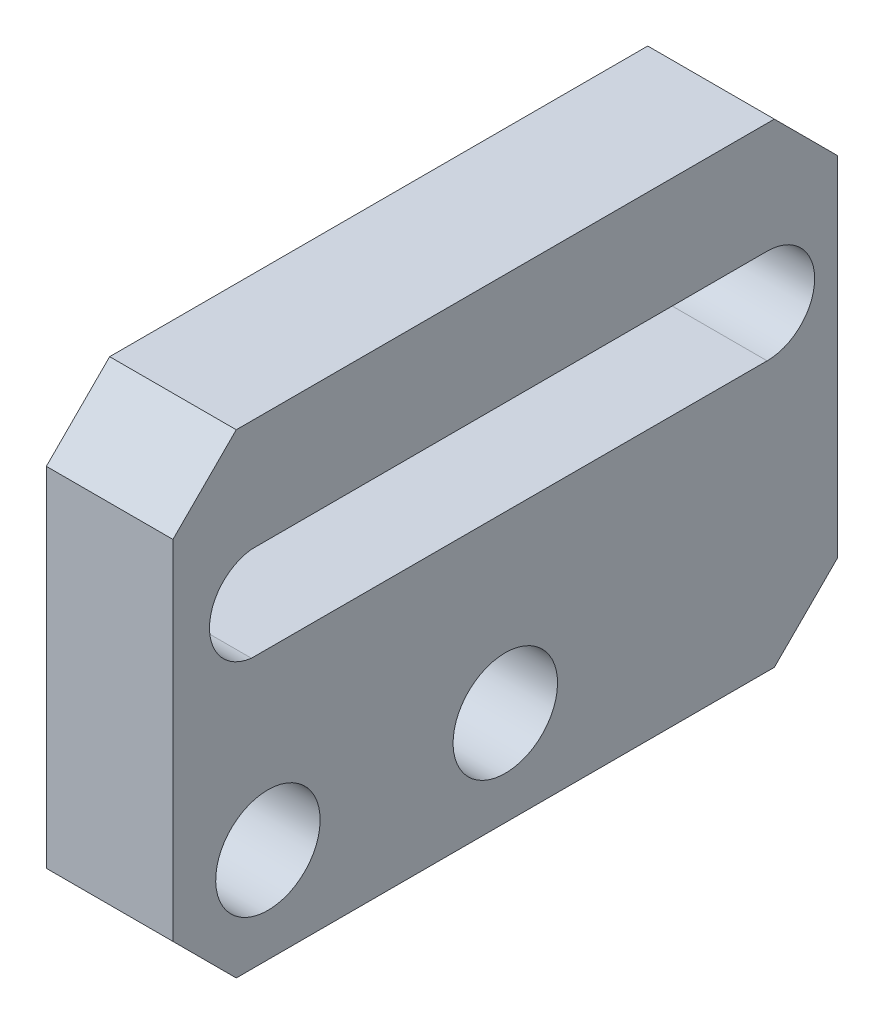
ISO-10303-21;
HEADER;
FILE_DESCRIPTION(('STEP AP214'),'2;1');
FILE_NAME('part.step','',(''),(''),'','','');
FILE_SCHEMA(('AUTOMOTIVE_DESIGN { 1 0 10303 214 1 1 1 1 }'));
ENDSEC;
DATA;
#1=APPLICATION_CONTEXT('core data for automotive mechanical design processes');
#2=APPLICATION_PROTOCOL_DEFINITION('international standard','automotive_design',2000,#1);
#3=PRODUCT_CONTEXT('',#1,'mechanical');
#4=PRODUCT('Part','Part','',(#3));
#5=PRODUCT_RELATED_PRODUCT_CATEGORY('part','',(#4));
#6=PRODUCT_DEFINITION_FORMATION('','',#4);
#7=PRODUCT_DEFINITION_CONTEXT('part definition',#1,'design');
#8=PRODUCT_DEFINITION('design','',#6,#7);
#9=PRODUCT_DEFINITION_SHAPE('','',#8);
#10=(LENGTH_UNIT() NAMED_UNIT(*) SI_UNIT(.MILLI.,.METRE.));
#11=(NAMED_UNIT(*) PLANE_ANGLE_UNIT() SI_UNIT($,.RADIAN.));
#12=(NAMED_UNIT(*) SI_UNIT($,.STERADIAN.) SOLID_ANGLE_UNIT());
#13=UNCERTAINTY_MEASURE_WITH_UNIT(LENGTH_MEASURE(1.E-05),#10,'distance_accuracy_value','');
#14=(GEOMETRIC_REPRESENTATION_CONTEXT(3) GLOBAL_UNCERTAINTY_ASSIGNED_CONTEXT((#13)) GLOBAL_UNIT_ASSIGNED_CONTEXT((#10,
#11,#12)) REPRESENTATION_CONTEXT('',''));
#15=CARTESIAN_POINT('',(0.,0.,0.));
#16=DIRECTION('',(0.,0.,1.));
#17=DIRECTION('',(1.,0.,0.));
#18=AXIS2_PLACEMENT_3D('',#15,#16,#17);
#19=CARTESIAN_POINT('',(-1.01692139953562,-16.9999992910889,-60.0000019322037));
#20=DIRECTION('',(0.,0.,-1.));
#21=DIRECTION('',(0.,-1.,0.));
#22=AXIS2_PLACEMENT_3D('',#19,#20,#21);
#23=PLANE('',#22);
#24=DIRECTION('',(1.,0.,0.));
#25=VECTOR('',#24,1.);
#26=CARTESIAN_POINT('',(-1.01692139953562,-25.9999992910889,-60.0000019322037));
#27=LINE('',#26,#25);
#28=CARTESIAN_POINT('',(-5.01692139953562,-25.9999992910889,-60.0000019322037));
#29=VERTEX_POINT('',#28);
#30=CARTESIAN_POINT('',(-1.01692139953562,-25.9999992910889,-60.0000019322037));
#31=VERTEX_POINT('',#30);
#32=EDGE_CURVE('E222',#29,#31,#27,.T.);
#33=ORIENTED_EDGE('',*,*,#32,.F.);
#34=DIRECTION('',(0.,-1.,0.));
#35=VECTOR('',#34,1.);
#36=CARTESIAN_POINT('',(-5.01692139953562,-26.9999992910889,-60.0000019322037));
#37=LINE('',#36,#35);
#38=CARTESIAN_POINT('',(-5.01692139953562,-14.9999992910889,-60.0000019322037));
#39=VERTEX_POINT('',#38);
#40=EDGE_CURVE('E178',#39,#29,#37,.T.);
#41=ORIENTED_EDGE('',*,*,#40,.F.);
#42=DIRECTION('',(-1.,0.,0.));
#43=VECTOR('',#42,1.);
#44=CARTESIAN_POINT('',(-1.01692139953562,-14.9999992910889,-60.0000019322037));
#45=LINE('',#44,#43);
#46=CARTESIAN_POINT('',(-1.01692139953562,-14.9999992910889,-60.0000019322037));
#47=VERTEX_POINT('',#46);
#48=EDGE_CURVE('E248',#47,#39,#45,.T.);
#49=ORIENTED_EDGE('',*,*,#48,.F.);
#50=DIRECTION('',(0.,-1.,0.));
#51=VECTOR('',#50,1.);
#52=CARTESIAN_POINT('',(-1.01692139953562,-26.9999992910889,-60.0000019322037));
#53=LINE('',#52,#51);
#54=EDGE_CURVE('E269',#47,#31,#53,.T.);
#55=ORIENTED_EDGE('',*,*,#54,.T.);
#56=EDGE_LOOP('',(#33,#41,#49,#55));
#57=FACE_BOUND('',#56,.T.);
#58=ADVANCED_FACE('F16',(#57),#23,.T.);
#59=CARTESIAN_POINT('',(-5.01692139953562,-25.000000372529,-49.5000006258488));
#60=DIRECTION('',(1.,0.,0.));
#61=DIRECTION('',(0.,-1.,0.));
#62=AXIS2_PLACEMENT_3D('',#59,#60,#61);
#63=CYLINDRICAL_SURFACE('',#62,1.65);
#64=CARTESIAN_POINT('',(-5.01692139953562,-25.000000372529,-49.5000006258488));
#65=DIRECTION('',(1.,0.,0.));
#66=DIRECTION('',(0.,-1.,0.));
#67=AXIS2_PLACEMENT_3D('',#64,#65,#66);
#68=CIRCLE('',#67,1.65);
#69=CARTESIAN_POINT('',(-5.01692139953562,-23.350000372529,-49.5000006258488));
#70=VERTEX_POINT('',#69);
#71=EDGE_CURVE('E205',#70,#70,#68,.T.);
#72=ORIENTED_EDGE('',*,*,#71,.F.);
#73=DIRECTION('',(1.,0.,0.));
#74=VECTOR('',#73,1.);
#75=CARTESIAN_POINT('',(-5.01692139953562,-23.350000372529,-49.5000006258488));
#76=LINE('',#75,#74);
#77=CARTESIAN_POINT('',(-1.01692139953562,-23.350000372529,-49.5000006258488));
#78=VERTEX_POINT('',#77);
#79=EDGE_CURVE('E11',#70,#78,#76,.T.);
#80=ORIENTED_EDGE('',*,*,#79,.T.);
#81=CARTESIAN_POINT('',(-1.01692139953562,-25.000000372529,-49.5000006258488));
#82=DIRECTION('',(-1.,0.,0.));
#83=DIRECTION('',(0.,-1.,0.));
#84=AXIS2_PLACEMENT_3D('',#81,#82,#83);
#85=CIRCLE('',#84,1.65);
#86=EDGE_CURVE('E200',#78,#78,#85,.T.);
#87=ORIENTED_EDGE('',*,*,#86,.F.);
#88=ORIENTED_EDGE('',*,*,#79,.F.);
#89=EDGE_LOOP('',(#72,#80,#87,#88));
#90=FACE_BOUND('',#89,.T.);
#91=ADVANCED_FACE('F298',(#90),#63,.F.);
#92=CARTESIAN_POINT('',(-5.01692139953562,-25.000000372529,-42.0000006258488));
#93=DIRECTION('',(1.,0.,0.));
#94=DIRECTION('',(0.,-1.,0.));
#95=AXIS2_PLACEMENT_3D('',#92,#93,#94);
#96=CYLINDRICAL_SURFACE('',#95,1.65);
#97=CARTESIAN_POINT('',(-5.01692139953562,-25.000000372529,-42.0000006258488));
#98=DIRECTION('',(1.,0.,0.));
#99=DIRECTION('',(0.,-1.,0.));
#100=AXIS2_PLACEMENT_3D('',#97,#98,#99);
#101=CIRCLE('',#100,1.65);
#102=CARTESIAN_POINT('',(-5.01692139953562,-23.350000372529,-42.0000006258488));
#103=VERTEX_POINT('',#102);
#104=EDGE_CURVE('E201',#103,#103,#101,.T.);
#105=ORIENTED_EDGE('',*,*,#104,.F.);
#106=DIRECTION('',(1.,0.,0.));
#107=VECTOR('',#106,1.);
#108=CARTESIAN_POINT('',(-5.01692139953562,-23.350000372529,-42.0000006258488));
#109=LINE('',#108,#107);
#110=CARTESIAN_POINT('',(-1.01692139953562,-23.350000372529,-42.0000006258488));
#111=VERTEX_POINT('',#110);
#112=EDGE_CURVE('E27',#103,#111,#109,.T.);
#113=ORIENTED_EDGE('',*,*,#112,.T.);
#114=CARTESIAN_POINT('',(-1.01692139953562,-25.000000372529,-42.0000006258488));
#115=DIRECTION('',(-1.,0.,0.));
#116=DIRECTION('',(0.,-1.,0.));
#117=AXIS2_PLACEMENT_3D('',#114,#115,#116);
#118=CIRCLE('',#117,1.65);
#119=EDGE_CURVE('E195',#111,#111,#118,.T.);
#120=ORIENTED_EDGE('',*,*,#119,.F.);
#121=ORIENTED_EDGE('',*,*,#112,.F.);
#122=EDGE_LOOP('',(#105,#113,#120,#121));
#123=FACE_BOUND('',#122,.T.);
#124=ADVANCED_FACE('F340',(#123),#96,.F.);
#125=CARTESIAN_POINT('',(-5.01692139953562,-18.000000372529,-57.7727991607441));
#126=DIRECTION('',(1.,0.,0.));
#127=DIRECTION('',(0.,0.,-1.));
#128=AXIS2_PLACEMENT_3D('',#125,#126,#127);
#129=CYLINDRICAL_SURFACE('',#128,1.5);
#130=CARTESIAN_POINT('',(-1.01692139953562,-18.000000372529,-57.7727991607441));
#131=DIRECTION('',(-1.,0.,0.));
#132=DIRECTION('',(0.,-1.,0.));
#133=AXIS2_PLACEMENT_3D('',#130,#131,#132);
#134=CIRCLE('',#133,1.5);
#135=CARTESIAN_POINT('',(-1.01692139953562,-16.5000006707244,-57.7718533352155));
#136=VERTEX_POINT('',#135);
#137=CARTESIAN_POINT('',(-1.01692139953562,-19.5000000743337,-57.7718533352155));
#138=VERTEX_POINT('',#137);
#139=EDGE_CURVE('E212',#136,#138,#134,.T.);
#140=ORIENTED_EDGE('',*,*,#139,.F.);
#141=DIRECTION('',(1.,0.,0.));
#142=VECTOR('',#141,1.);
#143=CARTESIAN_POINT('',(-5.01692139953562,-16.5000006707244,-57.7718533352155));
#144=LINE('',#143,#142);
#145=CARTESIAN_POINT('',(-5.01692139953562,-16.5000006707244,-57.7718533352155));
#146=VERTEX_POINT('',#145);
#147=EDGE_CURVE('E229',#146,#136,#144,.T.);
#148=ORIENTED_EDGE('',*,*,#147,.F.);
#149=CARTESIAN_POINT('',(-5.01692139953562,-18.000000372529,-57.7727991607441));
#150=DIRECTION('',(1.,0.,0.));
#151=DIRECTION('',(0.,-1.,0.));
#152=AXIS2_PLACEMENT_3D('',#149,#150,#151);
#153=CIRCLE('',#152,1.5);
#154=CARTESIAN_POINT('',(-5.01692139953562,-19.5000000743337,-57.7718533352155));
#155=VERTEX_POINT('',#154);
#156=EDGE_CURVE('E206',#155,#146,#153,.T.);
#157=ORIENTED_EDGE('',*,*,#156,.F.);
#158=DIRECTION('',(1.,0.,0.));
#159=VECTOR('',#158,1.);
#160=CARTESIAN_POINT('',(-5.01692139953562,-19.5000000743337,-57.7718533352155));
#161=LINE('',#160,#159);
#162=EDGE_CURVE('E110',#155,#138,#161,.T.);
#163=ORIENTED_EDGE('',*,*,#162,.T.);
#164=EDGE_LOOP('',(#140,#148,#157,#163));
#165=FACE_BOUND('',#164,.T.);
#166=ADVANCED_FACE('F338',(#165),#129,.F.);
#167=CARTESIAN_POINT('',(-5.01692139953562,-16.5000006707244,-57.7718533352155));
#168=DIRECTION('',(0.,0.999999801203107,0.000630550352393419));
#169=DIRECTION('',(1.,0.,0.));
#170=AXIS2_PLACEMENT_3D('',#167,#168,#169);
#171=PLANE('',#170);
#172=DIRECTION('',(0.,0.000630550352393419,-0.999999801203107));
#173=VECTOR('',#172,1.);
#174=CARTESIAN_POINT('',(-1.01692139953562,-16.5056340682165,-48.8377589351893));
#175=LINE('',#174,#173);
#176=CARTESIAN_POINT('',(-1.01692139953562,-16.510274255594,-41.4788122033596));
#177=VERTEX_POINT('',#176);
#178=EDGE_CURVE('E199',#177,#136,#175,.T.);
#179=ORIENTED_EDGE('',*,*,#178,.F.);
#180=DIRECTION('',(1.,0.,0.));
#181=VECTOR('',#180,1.);
#182=CARTESIAN_POINT('',(-5.01692139953562,-16.510274255594,-41.4788122033596));
#183=LINE('',#182,#181);
#184=CARTESIAN_POINT('',(-5.01692139953562,-16.510274255594,-41.4788122033596));
#185=VERTEX_POINT('',#184);
#186=EDGE_CURVE('E227',#185,#177,#183,.T.);
#187=ORIENTED_EDGE('',*,*,#186,.F.);
#188=DIRECTION('',(0.,-0.000630550352393419,0.999999801203107));
#189=VECTOR('',#188,1.);
#190=CARTESIAN_POINT('',(-5.01692139953562,-16.5056340682165,-48.8377589351893));
#191=LINE('',#190,#189);
#192=EDGE_CURVE('E236',#146,#185,#191,.T.);
#193=ORIENTED_EDGE('',*,*,#192,.F.);
#194=ORIENTED_EDGE('',*,*,#147,.T.);
#195=EDGE_LOOP('',(#179,#187,#193,#194));
#196=FACE_BOUND('',#195,.T.);
#197=ADVANCED_FACE('F312',(#196),#171,.F.);
#198=CARTESIAN_POINT('',(-5.01692139953562,-18.000000372529,-41.6540722858701));
#199=DIRECTION('',(1.,0.,0.));
#200=DIRECTION('',(0.,-1.,0.));
#201=AXIS2_PLACEMENT_3D('',#198,#199,#200);
#202=CYLINDRICAL_SURFACE('',#201,1.5);
#203=CARTESIAN_POINT('',(-1.01692139953562,-18.000000372529,-41.6540722858701));
#204=DIRECTION('',(-1.,0.,0.));
#205=DIRECTION('',(0.,-1.,0.));
#206=AXIS2_PLACEMENT_3D('',#203,#204,#205);
#207=CIRCLE('',#206,1.5);
#208=CARTESIAN_POINT('',(-1.01692139953562,-19.4897264894641,-41.4788122033596));
#209=VERTEX_POINT('',#208);
#210=EDGE_CURVE('E211',#209,#177,#207,.T.);
#211=ORIENTED_EDGE('',*,*,#210,.F.);
#212=DIRECTION('',(1.,0.,0.));
#213=VECTOR('',#212,1.);
#214=CARTESIAN_POINT('',(-5.01692139953562,-19.4897264894641,-41.4788122033596));
#215=LINE('',#214,#213);
#216=CARTESIAN_POINT('',(-5.01692139953562,-19.4897264894641,-41.4788122033596));
#217=VERTEX_POINT('',#216);
#218=EDGE_CURVE('E95',#217,#209,#215,.T.);
#219=ORIENTED_EDGE('',*,*,#218,.F.);
#220=CARTESIAN_POINT('',(-5.01692139953562,-18.000000372529,-41.6540722858701));
#221=DIRECTION('',(1.,0.,0.));
#222=DIRECTION('',(0.,-1.,0.));
#223=AXIS2_PLACEMENT_3D('',#220,#221,#222);
#224=CIRCLE('',#223,1.5);
#225=EDGE_CURVE('E231',#185,#217,#224,.T.);
#226=ORIENTED_EDGE('',*,*,#225,.F.);
#227=ORIENTED_EDGE('',*,*,#186,.T.);
#228=EDGE_LOOP('',(#211,#219,#226,#227));
#229=FACE_BOUND('',#228,.T.);
#230=ADVANCED_FACE('F315',(#229),#202,.F.);
#231=CARTESIAN_POINT('',(-5.01692139953562,-19.4897264894641,-41.4788122033596));
#232=DIRECTION('',(0.,-0.999999801203107,0.000630550352393418));
#233=DIRECTION('',(-1.,0.,0.));
#234=AXIS2_PLACEMENT_3D('',#231,#232,#233);
#235=PLANE('',#234);
#236=DIRECTION('',(0.,0.000630550352393418,0.999999801203107));
#237=VECTOR('',#236,1.);
#238=CARTESIAN_POINT('',(-1.01692139953562,-19.489226981823,-40.6866351156961));
#239=LINE('',#238,#237);
#240=EDGE_CURVE('E207',#138,#209,#239,.T.);
#241=ORIENTED_EDGE('',*,*,#240,.F.);
#242=ORIENTED_EDGE('',*,*,#162,.F.);
#243=DIRECTION('',(0.,-0.000630550352393418,-0.999999801203107));
#244=VECTOR('',#243,1.);
#245=CARTESIAN_POINT('',(-5.01692139953562,-19.489226981823,-40.6866351156961));
#246=LINE('',#245,#244);
#247=EDGE_CURVE('E235',#217,#155,#246,.T.);
#248=ORIENTED_EDGE('',*,*,#247,.F.);
#249=ORIENTED_EDGE('',*,*,#218,.T.);
#250=EDGE_LOOP('',(#241,#242,#248,#249));
#251=FACE_BOUND('',#250,.T.);
#252=ADVANCED_FACE('F316',(#251),#235,.F.);
#253=CARTESIAN_POINT('',(-1.01692139953562,-13.9999992910889,-40.0000019322037));
#254=DIRECTION('',(0.,0.707106781186547,0.707106781186548));
#255=DIRECTION('',(1.,0.,0.));
#256=AXIS2_PLACEMENT_3D('',#253,#254,#255);
#257=PLANE('',#256);
#258=DIRECTION('',(0.,-0.707106781186548,0.707106781186547));
#259=VECTOR('',#258,1.);
#260=CARTESIAN_POINT('',(-5.01692139953562,-13.1999061152455,-40.8000951080471));
#261=LINE('',#260,#259);
#262=CARTESIAN_POINT('',(-5.01692139953562,-12.9999992910889,-41.0000019322037));
#263=VERTEX_POINT('',#262);
#264=CARTESIAN_POINT('',(-5.01692139953562,-14.9999992910889,-39.0000019322037));
#265=VERTEX_POINT('',#264);
#266=EDGE_CURVE('E172',#263,#265,#261,.T.);
#267=ORIENTED_EDGE('',*,*,#266,.T.);
#268=DIRECTION('',(1.,0.,0.));
#269=VECTOR('',#268,1.);
#270=CARTESIAN_POINT('',(-1.01692139953562,-14.9999992910889,-39.0000019322037));
#271=LINE('',#270,#269);
#272=CARTESIAN_POINT('',(-1.01692139953562,-14.9999992910889,-39.0000019322037));
#273=VERTEX_POINT('',#272);
#274=EDGE_CURVE('E156',#265,#273,#271,.T.);
#275=ORIENTED_EDGE('',*,*,#274,.T.);
#276=DIRECTION('',(0.,0.707106781186548,-0.707106781186547));
#277=VECTOR('',#276,1.);
#278=CARTESIAN_POINT('',(-1.01692139953562,-13.1999061152455,-40.8000951080471));
#279=LINE('',#278,#277);
#280=CARTESIAN_POINT('',(-1.01692139953562,-12.9999992910889,-41.0000019322037));
#281=VERTEX_POINT('',#280);
#282=EDGE_CURVE('E240',#273,#281,#279,.T.);
#283=ORIENTED_EDGE('',*,*,#282,.T.);
#284=DIRECTION('',(-1.,0.,0.));
#285=VECTOR('',#284,1.);
#286=CARTESIAN_POINT('',(-1.01692139953562,-12.9999992910889,-41.0000019322037));
#287=LINE('',#286,#285);
#288=EDGE_CURVE('E174',#281,#263,#287,.T.);
#289=ORIENTED_EDGE('',*,*,#288,.T.);
#290=EDGE_LOOP('',(#267,#275,#283,#289));
#291=FACE_BOUND('',#290,.T.);
#292=ADVANCED_FACE('F173',(#291),#257,.T.);
#293=CARTESIAN_POINT('',(-1.01692139953562,-26.9999992910889,-39.0000019322037));
#294=DIRECTION('',(0.,0.,1.));
#295=DIRECTION('',(1.,0.,0.));
#296=AXIS2_PLACEMENT_3D('',#293,#294,#295);
#297=PLANE('',#296);
#298=DIRECTION('',(-1.,0.,0.));
#299=VECTOR('',#298,1.);
#300=CARTESIAN_POINT('',(-1.01692139953562,-25.9999992910889,-39.0000019322037));
#301=LINE('',#300,#299);
#302=CARTESIAN_POINT('',(-1.01692139953562,-25.9999992910889,-39.0000019322037));
#303=VERTEX_POINT('',#302);
#304=CARTESIAN_POINT('',(-5.01692139953562,-25.9999992910889,-39.0000019322037));
#305=VERTEX_POINT('',#304);
#306=EDGE_CURVE('E168',#303,#305,#301,.T.);
#307=ORIENTED_EDGE('',*,*,#306,.F.);
#308=DIRECTION('',(0.,-1.,0.));
#309=VECTOR('',#308,1.);
#310=CARTESIAN_POINT('',(-1.01692139953562,-26.9999992910889,-39.0000019322037));
#311=LINE('',#310,#309);
#312=EDGE_CURVE('E163',#273,#303,#311,.T.);
#313=ORIENTED_EDGE('',*,*,#312,.F.);
#314=ORIENTED_EDGE('',*,*,#274,.F.);
#315=DIRECTION('',(0.,-1.,0.));
#316=VECTOR('',#315,1.);
#317=CARTESIAN_POINT('',(-5.01692139953562,-16.9999992910889,-39.0000019322037));
#318=LINE('',#317,#316);
#319=EDGE_CURVE('E160',#265,#305,#318,.T.);
#320=ORIENTED_EDGE('',*,*,#319,.T.);
#321=EDGE_LOOP('',(#307,#313,#314,#320));
#322=FACE_BOUND('',#321,.T.);
#323=ADVANCED_FACE('F158',(#322),#297,.T.);
#324=CARTESIAN_POINT('',(-1.01692139953562,-26.9999992910889,-40.0000019322037));
#325=DIRECTION('',(0.,-0.707106781186547,0.707106781186548));
#326=DIRECTION('',(-1.,0.,0.));
#327=AXIS2_PLACEMENT_3D('',#324,#325,#326);
#328=PLANE('',#327);
#329=DIRECTION('',(0.,-0.707106781186548,-0.707106781186547));
#330=VECTOR('',#329,1.);
#331=CARTESIAN_POINT('',(-5.01692139953562,-22.8999051496503,-35.8999077907651));
#332=LINE('',#331,#330);
#333=CARTESIAN_POINT('',(-5.01692139953562,-27.9999992910889,-41.0000019322037));
#334=VERTEX_POINT('',#333);
#335=EDGE_CURVE('E183',#305,#334,#332,.T.);
#336=ORIENTED_EDGE('',*,*,#335,.T.);
#337=DIRECTION('',(1.,0.,0.));
#338=VECTOR('',#337,1.);
#339=CARTESIAN_POINT('',(-1.01692139953562,-27.9999992910889,-41.0000019322037));
#340=LINE('',#339,#338);
#341=CARTESIAN_POINT('',(-1.01692139953562,-27.9999992910889,-41.0000019322037));
#342=VERTEX_POINT('',#341);
#343=EDGE_CURVE('E221',#334,#342,#340,.T.);
#344=ORIENTED_EDGE('',*,*,#343,.T.);
#345=DIRECTION('',(0.,0.707106781186548,0.707106781186547));
#346=VECTOR('',#345,1.);
#347=CARTESIAN_POINT('',(-1.01692139953562,-22.8999051496503,-35.8999077907651));
#348=LINE('',#347,#346);
#349=EDGE_CURVE('E213',#342,#303,#348,.T.);
#350=ORIENTED_EDGE('',*,*,#349,.T.);
#351=ORIENTED_EDGE('',*,*,#306,.T.);
#352=EDGE_LOOP('',(#336,#344,#350,#351));
#353=FACE_BOUND('',#352,.T.);
#354=ADVANCED_FACE('F303',(#353),#328,.T.);
#355=CARTESIAN_POINT('',(-5.01692139953562,-10.699624656525,-39.9000000010132));
#356=DIRECTION('',(-1.,0.,0.));
#357=DIRECTION('',(0.,0.,1.));
#358=AXIS2_PLACEMENT_3D('',#355,#356,#357);
#359=PLANE('',#358);
#360=ORIENTED_EDGE('',*,*,#71,.T.);
#361=EDGE_LOOP('',(#360));
#362=FACE_BOUND('',#361,.T.);
#363=ORIENTED_EDGE('',*,*,#104,.T.);
#364=EDGE_LOOP('',(#363));
#365=FACE_BOUND('',#364,.T.);
#366=ORIENTED_EDGE('',*,*,#192,.T.);
#367=ORIENTED_EDGE('',*,*,#225,.T.);
#368=ORIENTED_EDGE('',*,*,#247,.T.);
#369=ORIENTED_EDGE('',*,*,#156,.T.);
#370=EDGE_LOOP('',(#366,#367,#368,#369));
#371=FACE_BOUND('',#370,.T.);
#372=DIRECTION('',(0.,0.707106781186548,-0.707106781186548));
#373=VECTOR('',#372,1.);
#374=CARTESIAN_POINT('',(-5.01692139953562,-27.6999061152455,-58.3000951080471));
#375=LINE('',#374,#373);
#376=CARTESIAN_POINT('',(-5.01692139953562,-27.9999992910889,-58.0000019322037));
#377=VERTEX_POINT('',#376);
#378=EDGE_CURVE('E260',#377,#29,#375,.T.);
#379=ORIENTED_EDGE('',*,*,#378,.F.);
#380=DIRECTION('',(0.,0.,-1.));
#381=VECTOR('',#380,1.);
#382=CARTESIAN_POINT('',(-5.01692139953562,-27.9999992910889,-55.0000019322037));
#383=LINE('',#382,#381);
#384=EDGE_CURVE('E273',#334,#377,#383,.T.);
#385=ORIENTED_EDGE('',*,*,#384,.F.);
#386=ORIENTED_EDGE('',*,*,#335,.F.);
#387=ORIENTED_EDGE('',*,*,#319,.F.);
#388=ORIENTED_EDGE('',*,*,#266,.F.);
#389=DIRECTION('',(0.,0.,-1.));
#390=VECTOR('',#389,1.);
#391=CARTESIAN_POINT('',(-5.01692139953562,-12.9999992910889,-39.9500009666085));
#392=LINE('',#391,#390);
#393=CARTESIAN_POINT('',(-5.01692139953562,-12.9999992910889,-58.0000019322037));
#394=VERTEX_POINT('',#393);
#395=EDGE_CURVE('E254',#263,#394,#392,.T.);
#396=ORIENTED_EDGE('',*,*,#395,.T.);
#397=DIRECTION('',(0.,0.707106781186549,0.707106781186546));
#398=VECTOR('',#397,1.);
#399=CARTESIAN_POINT('',(-5.01692139953562,-8.39990514965029,-53.3999077907651));
#400=LINE('',#399,#398);
#401=EDGE_CURVE('E193',#39,#394,#400,.T.);
#402=ORIENTED_EDGE('',*,*,#401,.F.);
#403=ORIENTED_EDGE('',*,*,#40,.T.);
#404=EDGE_LOOP('',(#379,#385,#386,#387,#388,#396,#402,#403));
#405=FACE_BOUND('',#404,.T.);
#406=ADVANCED_FACE('F181',(#362,#365,#371,#405),#359,.T.);
#407=CARTESIAN_POINT('',(-1.01692139953562,-12.9999992910889,-40.0000019322037));
#408=DIRECTION('',(0.,-1.,0.));
#409=DIRECTION('',(0.,0.,-1.));
#410=AXIS2_PLACEMENT_3D('',#407,#408,#409);
#411=PLANE('',#410);
#412=DIRECTION('',(1.,0.,0.));
#413=VECTOR('',#412,1.);
#414=CARTESIAN_POINT('',(-1.01692139953562,-12.9999992910889,-58.0000019322037));
#415=LINE('',#414,#413);
#416=CARTESIAN_POINT('',(-1.01692139953562,-12.9999992910889,-58.0000019322037));
#417=VERTEX_POINT('',#416);
#418=EDGE_CURVE('E262',#394,#417,#415,.T.);
#419=ORIENTED_EDGE('',*,*,#418,.F.);
#420=ORIENTED_EDGE('',*,*,#395,.F.);
#421=ORIENTED_EDGE('',*,*,#288,.F.);
#422=DIRECTION('',(0.,0.,1.));
#423=VECTOR('',#422,1.);
#424=CARTESIAN_POINT('',(-1.01692139953562,-12.9999992910889,-39.9500009666085));
#425=LINE('',#424,#423);
#426=EDGE_CURVE('E242',#417,#281,#425,.T.);
#427=ORIENTED_EDGE('',*,*,#426,.F.);
#428=EDGE_LOOP('',(#419,#420,#421,#427));
#429=FACE_BOUND('',#428,.T.);
#430=ADVANCED_FACE('F302',(#429),#411,.F.);
#431=CARTESIAN_POINT('',(-1.01692139953562,-13.9999992910889,-59.0000019322037));
#432=DIRECTION('',(0.,0.707106781186546,-0.707106781186549));
#433=DIRECTION('',(-1.,0.,0.));
#434=AXIS2_PLACEMENT_3D('',#431,#432,#433);
#435=PLANE('',#434);
#436=DIRECTION('',(0.,-0.707106781186549,-0.707106781186546));
#437=VECTOR('',#436,1.);
#438=CARTESIAN_POINT('',(-1.01692139953562,-8.39990514965029,-53.3999077907651));
#439=LINE('',#438,#437);
#440=EDGE_CURVE('E272',#417,#47,#439,.T.);
#441=ORIENTED_EDGE('',*,*,#440,.T.);
#442=ORIENTED_EDGE('',*,*,#48,.T.);
#443=ORIENTED_EDGE('',*,*,#401,.T.);
#444=ORIENTED_EDGE('',*,*,#418,.T.);
#445=EDGE_LOOP('',(#441,#442,#443,#444));
#446=FACE_BOUND('',#445,.T.);
#447=ADVANCED_FACE('F18',(#446),#435,.T.);
#448=CARTESIAN_POINT('',(-1.01692139953562,-10.699624656525,-39.9000000010132));
#449=DIRECTION('',(-1.,0.,0.));
#450=DIRECTION('',(0.,1.,0.));
#451=AXIS2_PLACEMENT_3D('',#448,#449,#450);
#452=PLANE('',#451);
#453=ORIENTED_EDGE('',*,*,#178,.T.);
#454=ORIENTED_EDGE('',*,*,#139,.T.);
#455=ORIENTED_EDGE('',*,*,#240,.T.);
#456=ORIENTED_EDGE('',*,*,#210,.T.);
#457=EDGE_LOOP('',(#453,#454,#455,#456));
#458=FACE_BOUND('',#457,.T.);
#459=ORIENTED_EDGE('',*,*,#119,.T.);
#460=EDGE_LOOP('',(#459));
#461=FACE_BOUND('',#460,.T.);
#462=ORIENTED_EDGE('',*,*,#86,.T.);
#463=EDGE_LOOP('',(#462));
#464=FACE_BOUND('',#463,.T.);
#465=DIRECTION('',(0.,-0.707106781186548,0.707106781186548));
#466=VECTOR('',#465,1.);
#467=CARTESIAN_POINT('',(-1.01692139953562,-27.6999061152455,-58.3000951080471));
#468=LINE('',#467,#466);
#469=CARTESIAN_POINT('',(-1.01692139953562,-27.9999992910889,-58.0000019322037));
#470=VERTEX_POINT('',#469);
#471=EDGE_CURVE('E20',#31,#470,#468,.T.);
#472=ORIENTED_EDGE('',*,*,#471,.F.);
#473=ORIENTED_EDGE('',*,*,#54,.F.);
#474=ORIENTED_EDGE('',*,*,#440,.F.);
#475=ORIENTED_EDGE('',*,*,#426,.T.);
#476=ORIENTED_EDGE('',*,*,#282,.F.);
#477=ORIENTED_EDGE('',*,*,#312,.T.);
#478=ORIENTED_EDGE('',*,*,#349,.F.);
#479=DIRECTION('',(0.,0.,1.));
#480=VECTOR('',#479,1.);
#481=CARTESIAN_POINT('',(-1.01692139953562,-27.9999992910889,-55.0000019322037));
#482=LINE('',#481,#480);
#483=EDGE_CURVE('E217',#470,#342,#482,.T.);
#484=ORIENTED_EDGE('',*,*,#483,.F.);
#485=EDGE_LOOP('',(#472,#473,#474,#475,#476,#477,#478,#484));
#486=FACE_BOUND('',#485,.T.);
#487=ADVANCED_FACE('F296',(#458,#461,#464,#486),#452,.F.);
#488=CARTESIAN_POINT('',(-1.01692139953562,-27.9999992910889,-55.0000019322037));
#489=DIRECTION('',(0.,-1.,0.));
#490=DIRECTION('',(0.,0.,-1.));
#491=AXIS2_PLACEMENT_3D('',#488,#489,#490);
#492=PLANE('',#491);
#493=DIRECTION('',(-1.,0.,0.));
#494=VECTOR('',#493,1.);
#495=CARTESIAN_POINT('',(-1.01692139953562,-27.9999992910889,-58.0000019322037));
#496=LINE('',#495,#494);
#497=EDGE_CURVE('E277',#470,#377,#496,.T.);
#498=ORIENTED_EDGE('',*,*,#497,.F.);
#499=ORIENTED_EDGE('',*,*,#483,.T.);
#500=ORIENTED_EDGE('',*,*,#343,.F.);
#501=ORIENTED_EDGE('',*,*,#384,.T.);
#502=EDGE_LOOP('',(#498,#499,#500,#501));
#503=FACE_BOUND('',#502,.T.);
#504=ADVANCED_FACE('F362',(#503),#492,.T.);
#505=CARTESIAN_POINT('',(-1.01692139953562,-26.9999992910889,-59.0000019322037));
#506=DIRECTION('',(0.,-0.707106781186548,-0.707106781186548));
#507=DIRECTION('',(0.,-0.707106781186548,0.707106781186548));
#508=AXIS2_PLACEMENT_3D('',#505,#506,#507);
#509=PLANE('',#508);
#510=ORIENTED_EDGE('',*,*,#471,.T.);
#511=ORIENTED_EDGE('',*,*,#497,.T.);
#512=ORIENTED_EDGE('',*,*,#378,.T.);
#513=ORIENTED_EDGE('',*,*,#32,.T.);
#514=EDGE_LOOP('',(#510,#511,#512,#513));
#515=FACE_BOUND('',#514,.T.);
#516=ADVANCED_FACE('F364',(#515),#509,.T.);
#517=CLOSED_SHELL('',(#58,#91,#124,#166,#197,#230,#252,#292,#323,#354,#406,#430,#447,#487,#504,#516));
#518=MANIFOLD_SOLID_BREP('B1',#517);
#519=ADVANCED_BREP_SHAPE_REPRESENTATION('',(#18,#518),#14);
#520=SHAPE_DEFINITION_REPRESENTATION(#9,#519);
ENDSEC;
END-ISO-10303-21;
